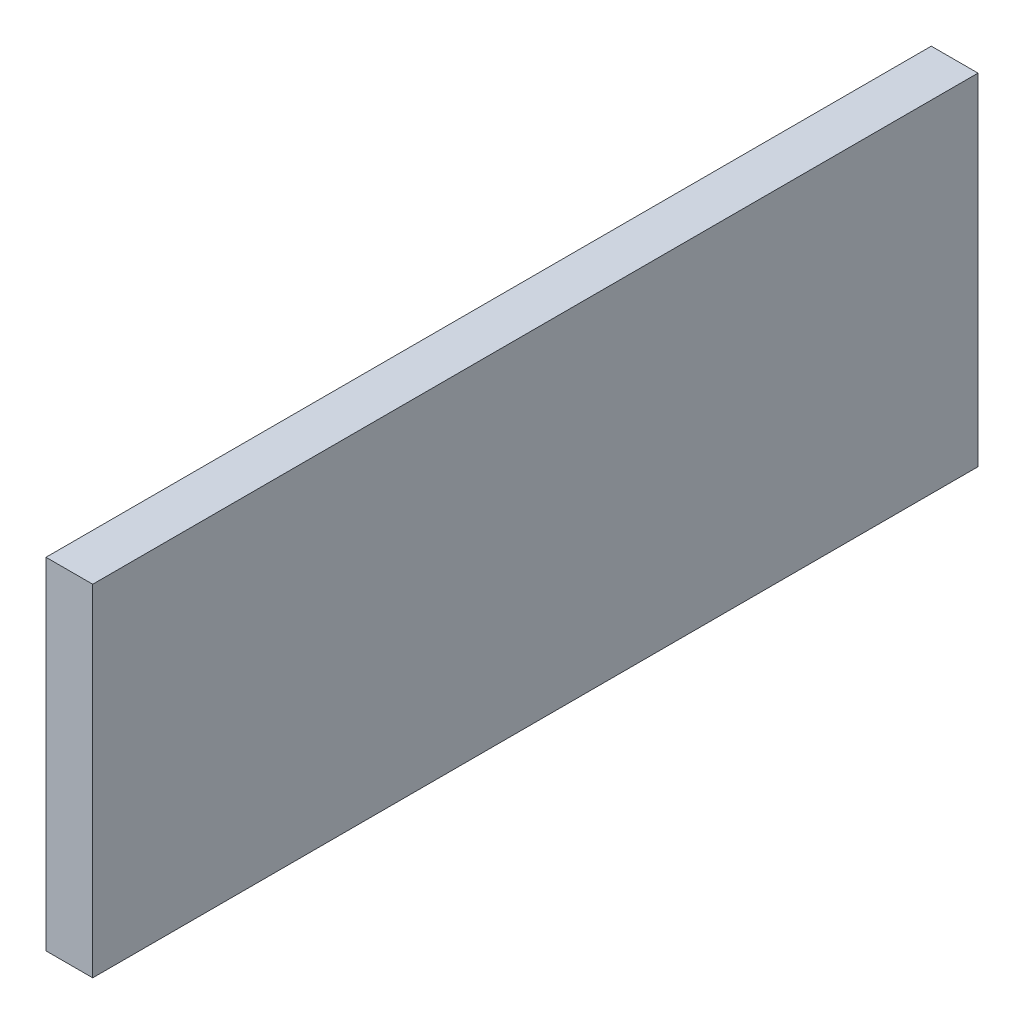
ISO-10303-21;
HEADER;
FILE_DESCRIPTION(('STEP AP214'),'2;1');
FILE_NAME('part.step','',(''),(''),'','','');
FILE_SCHEMA(('AUTOMOTIVE_DESIGN { 1 0 10303 214 1 1 1 1 }'));
ENDSEC;
DATA;
#1=APPLICATION_CONTEXT('core data for automotive mechanical design processes');
#2=APPLICATION_PROTOCOL_DEFINITION('international standard','automotive_design',2000,#1);
#3=PRODUCT_CONTEXT('',#1,'mechanical');
#4=PRODUCT('Part','Part','',(#3));
#5=PRODUCT_RELATED_PRODUCT_CATEGORY('part','',(#4));
#6=PRODUCT_DEFINITION_FORMATION('','',#4);
#7=PRODUCT_DEFINITION_CONTEXT('part definition',#1,'design');
#8=PRODUCT_DEFINITION('design','',#6,#7);
#9=PRODUCT_DEFINITION_SHAPE('','',#8);
#10=(LENGTH_UNIT() NAMED_UNIT(*) SI_UNIT(.MILLI.,.METRE.));
#11=(NAMED_UNIT(*) PLANE_ANGLE_UNIT() SI_UNIT($,.RADIAN.));
#12=(NAMED_UNIT(*) SI_UNIT($,.STERADIAN.) SOLID_ANGLE_UNIT());
#13=UNCERTAINTY_MEASURE_WITH_UNIT(LENGTH_MEASURE(1.E-05),#10,'distance_accuracy_value','');
#14=(GEOMETRIC_REPRESENTATION_CONTEXT(3) GLOBAL_UNCERTAINTY_ASSIGNED_CONTEXT((#13)) GLOBAL_UNIT_ASSIGNED_CONTEXT((#10,
#11,#12)) REPRESENTATION_CONTEXT('',''));
#15=CARTESIAN_POINT('',(0.,0.,0.));
#16=DIRECTION('',(0.,0.,1.));
#17=DIRECTION('',(1.,0.,0.));
#18=AXIS2_PLACEMENT_3D('',#15,#16,#17);
#19=CARTESIAN_POINT('',(1.5875,11.585,60.17));
#20=DIRECTION('',(-1.,0.,0.));
#21=DIRECTION('',(0.,-1.,0.));
#22=AXIS2_PLACEMENT_3D('',#19,#20,#21);
#23=PLANE('',#22);
#24=DIRECTION('',(0.,1.,0.));
#25=VECTOR('',#24,1.);
#26=CARTESIAN_POINT('',(1.5875,11.585,0.));
#27=LINE('',#26,#25);
#28=CARTESIAN_POINT('',(1.5875,-11.585,0.));
#29=VERTEX_POINT('',#28);
#30=CARTESIAN_POINT('',(1.5875,11.585,0.));
#31=VERTEX_POINT('',#30);
#32=EDGE_CURVE('E107',#29,#31,#27,.T.);
#33=ORIENTED_EDGE('',*,*,#32,.T.);
#34=DIRECTION('',(0.,0.,-1.));
#35=VECTOR('',#34,1.);
#36=CARTESIAN_POINT('',(1.5875,11.585,60.17));
#37=LINE('',#36,#35);
#38=CARTESIAN_POINT('',(1.5875,11.585,60.17));
#39=VERTEX_POINT('',#38);
#40=EDGE_CURVE('E11',#39,#31,#37,.T.);
#41=ORIENTED_EDGE('',*,*,#40,.F.);
#42=DIRECTION('',(0.,1.,0.));
#43=VECTOR('',#42,1.);
#44=CARTESIAN_POINT('',(1.5875,11.585,60.17));
#45=LINE('',#44,#43);
#46=CARTESIAN_POINT('',(1.5875,-11.585,60.17));
#47=VERTEX_POINT('',#46);
#48=EDGE_CURVE('E91',#47,#39,#45,.T.);
#49=ORIENTED_EDGE('',*,*,#48,.F.);
#50=DIRECTION('',(0.,0.,-1.));
#51=VECTOR('',#50,1.);
#52=CARTESIAN_POINT('',(1.5875,-11.585,60.17));
#53=LINE('',#52,#51);
#54=EDGE_CURVE('E103',#47,#29,#53,.T.);
#55=ORIENTED_EDGE('',*,*,#54,.T.);
#56=EDGE_LOOP('',(#33,#41,#49,#55));
#57=FACE_BOUND('',#56,.T.);
#58=ADVANCED_FACE('F39',(#57),#23,.F.);
#59=CARTESIAN_POINT('',(-1.5875,11.585,60.17));
#60=DIRECTION('',(0.,-1.,0.));
#61=DIRECTION('',(0.,0.,-1.));
#62=AXIS2_PLACEMENT_3D('',#59,#60,#61);
#63=PLANE('',#62);
#64=DIRECTION('',(-1.,0.,0.));
#65=VECTOR('',#64,1.);
#66=CARTESIAN_POINT('',(-1.5875,11.585,0.));
#67=LINE('',#66,#65);
#68=CARTESIAN_POINT('',(-1.5875,11.585,0.));
#69=VERTEX_POINT('',#68);
#70=EDGE_CURVE('E96',#31,#69,#67,.T.);
#71=ORIENTED_EDGE('',*,*,#70,.T.);
#72=DIRECTION('',(0.,0.,-1.));
#73=VECTOR('',#72,1.);
#74=CARTESIAN_POINT('',(-1.5875,11.585,60.17));
#75=LINE('',#74,#73);
#76=CARTESIAN_POINT('',(-1.5875,11.585,60.17));
#77=VERTEX_POINT('',#76);
#78=EDGE_CURVE('E48',#77,#69,#75,.T.);
#79=ORIENTED_EDGE('',*,*,#78,.F.);
#80=DIRECTION('',(-1.,0.,0.));
#81=VECTOR('',#80,1.);
#82=CARTESIAN_POINT('',(-1.5875,11.585,60.17));
#83=LINE('',#82,#81);
#84=EDGE_CURVE('E86',#39,#77,#83,.T.);
#85=ORIENTED_EDGE('',*,*,#84,.F.);
#86=ORIENTED_EDGE('',*,*,#40,.T.);
#87=EDGE_LOOP('',(#71,#79,#85,#86));
#88=FACE_BOUND('',#87,.T.);
#89=ADVANCED_FACE('F95',(#88),#63,.F.);
#90=CARTESIAN_POINT('',(-1.5875,11.585,60.17));
#91=DIRECTION('',(1.,0.,0.));
#92=DIRECTION('',(0.,1.,0.));
#93=AXIS2_PLACEMENT_3D('',#90,#91,#92);
#94=PLANE('',#93);
#95=DIRECTION('',(0.,-1.,0.));
#96=VECTOR('',#95,1.);
#97=CARTESIAN_POINT('',(-1.5875,11.585,0.));
#98=LINE('',#97,#96);
#99=CARTESIAN_POINT('',(-1.5875,-11.585,0.));
#100=VERTEX_POINT('',#99);
#101=EDGE_CURVE('E73',#69,#100,#98,.T.);
#102=ORIENTED_EDGE('',*,*,#101,.T.);
#103=DIRECTION('',(0.,0.,-1.));
#104=VECTOR('',#103,1.);
#105=CARTESIAN_POINT('',(-1.5875,-11.585,60.17));
#106=LINE('',#105,#104);
#107=CARTESIAN_POINT('',(-1.5875,-11.585,60.17));
#108=VERTEX_POINT('',#107);
#109=EDGE_CURVE('E98',#108,#100,#106,.T.);
#110=ORIENTED_EDGE('',*,*,#109,.F.);
#111=DIRECTION('',(0.,-1.,0.));
#112=VECTOR('',#111,1.);
#113=CARTESIAN_POINT('',(-1.5875,11.585,60.17));
#114=LINE('',#113,#112);
#115=EDGE_CURVE('E89',#77,#108,#114,.T.);
#116=ORIENTED_EDGE('',*,*,#115,.F.);
#117=ORIENTED_EDGE('',*,*,#78,.T.);
#118=EDGE_LOOP('',(#102,#110,#116,#117));
#119=FACE_BOUND('',#118,.T.);
#120=ADVANCED_FACE('F99',(#119),#94,.F.);
#121=CARTESIAN_POINT('',(-1.5875,-11.585,60.17));
#122=DIRECTION('',(0.,1.,0.));
#123=DIRECTION('',(0.,0.,1.));
#124=AXIS2_PLACEMENT_3D('',#121,#122,#123);
#125=PLANE('',#124);
#126=DIRECTION('',(1.,0.,0.));
#127=VECTOR('',#126,1.);
#128=CARTESIAN_POINT('',(-1.5875,-11.585,0.));
#129=LINE('',#128,#127);
#130=EDGE_CURVE('E79',#100,#29,#129,.T.);
#131=ORIENTED_EDGE('',*,*,#130,.T.);
#132=ORIENTED_EDGE('',*,*,#54,.F.);
#133=DIRECTION('',(1.,0.,0.));
#134=VECTOR('',#133,1.);
#135=CARTESIAN_POINT('',(-1.5875,-11.585,60.17));
#136=LINE('',#135,#134);
#137=EDGE_CURVE('E56',#108,#47,#136,.T.);
#138=ORIENTED_EDGE('',*,*,#137,.F.);
#139=ORIENTED_EDGE('',*,*,#109,.T.);
#140=EDGE_LOOP('',(#131,#132,#138,#139));
#141=FACE_BOUND('',#140,.T.);
#142=ADVANCED_FACE('F120',(#141),#125,.F.);
#143=CARTESIAN_POINT('',(0.,0.,60.17));
#144=DIRECTION('',(0.,0.,1.));
#145=DIRECTION('',(1.,0.,0.));
#146=AXIS2_PLACEMENT_3D('',#143,#144,#145);
#147=PLANE('',#146);
#148=ORIENTED_EDGE('',*,*,#48,.T.);
#149=ORIENTED_EDGE('',*,*,#84,.T.);
#150=ORIENTED_EDGE('',*,*,#115,.T.);
#151=ORIENTED_EDGE('',*,*,#137,.T.);
#152=EDGE_LOOP('',(#148,#149,#150,#151));
#153=FACE_BOUND('',#152,.T.);
#154=ADVANCED_FACE('F87',(#153),#147,.T.);
#155=CARTESIAN_POINT('',(0.,0.,0.));
#156=DIRECTION('',(0.,0.,1.));
#157=DIRECTION('',(1.,0.,0.));
#158=AXIS2_PLACEMENT_3D('',#155,#156,#157);
#159=PLANE('',#158);
#160=ORIENTED_EDGE('',*,*,#32,.F.);
#161=ORIENTED_EDGE('',*,*,#130,.F.);
#162=ORIENTED_EDGE('',*,*,#101,.F.);
#163=ORIENTED_EDGE('',*,*,#70,.F.);
#164=EDGE_LOOP('',(#160,#161,#162,#163));
#165=FACE_BOUND('',#164,.T.);
#166=ADVANCED_FACE('F123',(#165),#159,.F.);
#167=CLOSED_SHELL('',(#58,#89,#120,#142,#154,#166));
#168=MANIFOLD_SOLID_BREP('B2',#167);
#169=ADVANCED_BREP_SHAPE_REPRESENTATION('',(#18,#168),#14);
#170=SHAPE_DEFINITION_REPRESENTATION(#9,#169);
ENDSEC;
END-ISO-10303-21;
